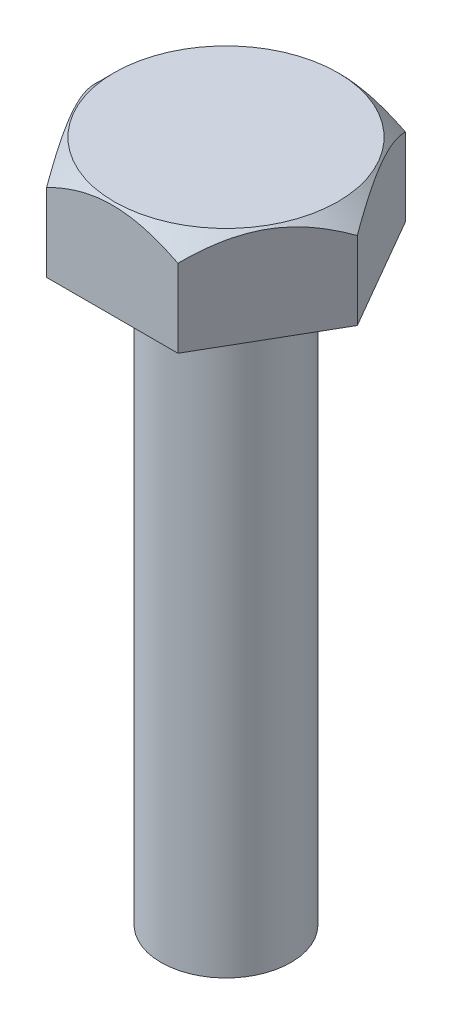
ISO-10303-21;
HEADER;
FILE_DESCRIPTION(('STEP AP214'),'2;1');
FILE_NAME('part.step','',(''),(''),'','','');
FILE_SCHEMA(('AUTOMOTIVE_DESIGN { 1 0 10303 214 1 1 1 1 }'));
ENDSEC;
DATA;
#1=APPLICATION_CONTEXT('core data for automotive mechanical design processes');
#2=APPLICATION_PROTOCOL_DEFINITION('international standard','automotive_design',2000,#1);
#3=PRODUCT_CONTEXT('',#1,'mechanical');
#4=PRODUCT('Part','Part','',(#3));
#5=PRODUCT_RELATED_PRODUCT_CATEGORY('part','',(#4));
#6=PRODUCT_DEFINITION_FORMATION('','',#4);
#7=PRODUCT_DEFINITION_CONTEXT('part definition',#1,'design');
#8=PRODUCT_DEFINITION('design','',#6,#7);
#9=PRODUCT_DEFINITION_SHAPE('','',#8);
#10=(LENGTH_UNIT() NAMED_UNIT(*) SI_UNIT(.MILLI.,.METRE.));
#11=(NAMED_UNIT(*) PLANE_ANGLE_UNIT() SI_UNIT($,.RADIAN.));
#12=(NAMED_UNIT(*) SI_UNIT($,.STERADIAN.) SOLID_ANGLE_UNIT());
#13=UNCERTAINTY_MEASURE_WITH_UNIT(LENGTH_MEASURE(1.E-05),#10,'distance_accuracy_value','');
#14=(GEOMETRIC_REPRESENTATION_CONTEXT(3) GLOBAL_UNCERTAINTY_ASSIGNED_CONTEXT((#13)) GLOBAL_UNIT_ASSIGNED_CONTEXT((#10,
#11,#12)) REPRESENTATION_CONTEXT('',''));
#15=CARTESIAN_POINT('',(0.,0.,0.));
#16=DIRECTION('',(0.,0.,1.));
#17=DIRECTION('',(1.,0.,0.));
#18=AXIS2_PLACEMENT_3D('',#15,#16,#17);
#19=CARTESIAN_POINT('',(0.,105.,0.));
#20=DIRECTION('',(0.,-1.,0.));
#21=DIRECTION('',(0.,0.,-1.));
#22=AXIS2_PLACEMENT_3D('',#19,#20,#21);
#23=CYLINDRICAL_SURFACE('',#22,10.);
#24=CARTESIAN_POINT('',(0.,0.,0.));
#25=DIRECTION('',(0.,1.,0.));
#26=DIRECTION('',(0.,0.,1.));
#27=AXIS2_PLACEMENT_3D('',#24,#25,#26);
#28=CIRCLE('',#27,10.);
#29=CARTESIAN_POINT('',(0.,0.,10.));
#30=VERTEX_POINT('',#29);
#31=EDGE_CURVE('E44',#30,#30,#28,.T.);
#32=ORIENTED_EDGE('',*,*,#31,.T.);
#33=EDGE_LOOP('',(#32));
#34=FACE_BOUND('',#33,.T.);
#35=CARTESIAN_POINT('',(0.,90.,0.));
#36=DIRECTION('',(0.,1.,0.));
#37=DIRECTION('',(0.,0.,1.));
#38=AXIS2_PLACEMENT_3D('',#35,#36,#37);
#39=CIRCLE('',#38,10.);
#40=CARTESIAN_POINT('',(0.,90.,10.));
#41=VERTEX_POINT('',#40);
#42=EDGE_CURVE('E11',#41,#41,#39,.T.);
#43=ORIENTED_EDGE('',*,*,#42,.F.);
#44=EDGE_LOOP('',(#43));
#45=FACE_BOUND('',#44,.T.);
#46=ADVANCED_FACE('F37',(#34,#45),#23,.T.);
#47=CARTESIAN_POINT('',(0.,0.,0.));
#48=DIRECTION('',(0.,1.,0.));
#49=DIRECTION('',(0.,0.,1.));
#50=AXIS2_PLACEMENT_3D('',#47,#48,#49);
#51=PLANE('',#50);
#52=ORIENTED_EDGE('',*,*,#31,.F.);
#53=EDGE_LOOP('',(#52));
#54=FACE_BOUND('',#53,.T.);
#55=ADVANCED_FACE('F216',(#54),#51,.F.);
#56=CARTESIAN_POINT('',(10.1036297108185,90.,17.5));
#57=DIRECTION('',(0.866025403784439,0.,0.5));
#58=DIRECTION('',(0.5,0.,-0.866025403784439));
#59=AXIS2_PLACEMENT_3D('',#56,#57,#58);
#60=PLANE('',#59);
#61=CARTESIAN_POINT('',(10.1035142407646,101.999884528956,17.5002));
#62=CARTESIAN_POINT('',(10.2772161959531,102.173559487261,17.1993393882395));
#63=CARTESIAN_POINT('',(10.4522785203478,102.341934743212,16.8961225478967));
#64=CARTESIAN_POINT('',(10.8053356136328,102.666402447814,16.2846097243545));
#65=CARTESIAN_POINT('',(10.9833319207208,102.822488188631,15.9763110769185));
#66=CARTESIAN_POINT('',(11.3433081877332,103.12135445128,15.352813892934));
#67=CARTESIAN_POINT('',(11.5253051210228,103.264053677999,15.0375859576548));
#68=CARTESIAN_POINT('',(11.8922882850367,103.533047605295,14.4019524720603));
#69=CARTESIAN_POINT('',(12.0772740538746,103.659344813841,14.0815477217558));
#70=CARTESIAN_POINT('',(12.44725994668,103.891538952211,13.4407133573331));
#71=CARTESIAN_POINT('',(12.6322146110496,103.997724008582,13.1203624815482));
#72=CARTESIAN_POINT('',(13.0047186861912,104.189961512046,12.4751664973764));
#73=CARTESIAN_POINT('',(13.1922678205565,104.276016086548,12.1503218677402));
#74=CARTESIAN_POINT('',(13.5691500136548,104.425830143622,11.497542760826));
#75=CARTESIAN_POINT('',(13.7584780520587,104.489639829176,11.169616979013));
#76=CARTESIAN_POINT('',(14.1387473508711,104.593546030956,10.5109712329114));
#77=CARTESIAN_POINT('',(14.3296883659053,104.633646090391,10.1802516936234));
#78=CARTESIAN_POINT('',(14.6580198048184,104.681136027447,9.61156495970376));
#79=CARTESIAN_POINT('',(14.7951975895102,104.694584979184,9.37396606694768));
#80=CARTESIAN_POINT('',(15.0697152233136,104.708570287283,8.8984875776267));
#81=CARTESIAN_POINT('',(15.2070550635686,104.709107319318,8.66060799640154));
#82=CARTESIAN_POINT('',(15.481643405491,104.697255908973,8.18500703702598));
#83=CARTESIAN_POINT('',(15.6188918561521,104.684862791294,7.94728574722088));
#84=CARTESIAN_POINT('',(15.8929528114817,104.647336049026,7.47259824821914));
#85=CARTESIAN_POINT('',(16.0297653086353,104.622202205996,7.23563205203874));
#86=CARTESIAN_POINT('',(16.3028186204356,104.559533617149,6.76268984282561));
#87=CARTESIAN_POINT('',(16.4390587105288,104.521986261661,6.52671508475635));
#88=CARTESIAN_POINT('',(16.7105947235602,104.435032232242,6.05640091410142));
#89=CARTESIAN_POINT('',(16.8458905305783,104.385624127752,5.82206170229488));
#90=CARTESIAN_POINT('',(17.2499926953934,104.220577791575,5.12213622138665));
#91=CARTESIAN_POINT('',(17.517116473681,104.088093139179,4.65946426548276));
#92=CARTESIAN_POINT('',(17.991245682429,103.81554732431,3.83824838657876));
#93=CARTESIAN_POINT('',(18.1993101803341,103.682656146477,3.47787010495577));
#94=CARTESIAN_POINT('',(18.6117124834375,103.395460303209,2.7635683628223));
#95=CARTESIAN_POINT('',(18.8160501758361,103.241154990841,2.40964509768665));
#96=CARTESIAN_POINT('',(19.2203451767528,102.914589886871,1.70938561485276));
#97=CARTESIAN_POINT('',(19.4203139893267,102.742386561871,1.36302947154561));
#98=CARTESIAN_POINT('',(19.8165491345014,102.38228567855,0.676730068358598));
#99=CARTESIAN_POINT('',(20.0128176475457,102.194397740954,0.336783031839831));
#100=CARTESIAN_POINT('',(20.2073748916907,101.999884528956,-0.000200000000004354));
#101=B_SPLINE_CURVE_WITH_KNOTS('',3,(#61,#62,#63,#64,#65,#66,#67,#68,#69,#70,#71,#72,#73,#74,
#75,#76,#77,#78,#79,#80,#81,#82,#83,#84,#85,#86,#87,#88,#89,#90,#91,#92,#93,#94,#95,#96,#97,#98,
#99,#100),.UNSPECIFIED.,.F.,.F.,(4,2,2,2,2,2,2,2,2,2,2,2,2,2,2,2,2,2,2,4),(0.,1.16524130204616,
2.331114266738,3.50366238917903,4.67603101025307,5.83006665851043,6.98398029200301,
8.13527261579806,9.28639284486991,10.110166338034,10.9338967235431,11.7579250578055,
12.5819675205788,13.4068496324916,14.2318312857993,15.8811762055264,17.1910983801914,
18.5010601368632,19.807007793264,21.112160203878),.UNSPECIFIED.);
#102=CARTESIAN_POINT('',(10.1036297108185,102.,17.5));
#103=VERTEX_POINT('',#102);
#104=CARTESIAN_POINT('',(20.2072594216369,102.,0.));
#105=VERTEX_POINT('',#104);
#106=EDGE_CURVE('E51',#103,#105,#101,.T.);
#107=ORIENTED_EDGE('',*,*,#106,.F.);
#108=DIRECTION('',(0.,1.,0.));
#109=VECTOR('',#108,1.);
#110=CARTESIAN_POINT('',(10.1036297108185,90.,17.5));
#111=LINE('',#110,#109);
#112=CARTESIAN_POINT('',(10.1036297108185,90.,17.5));
#113=VERTEX_POINT('',#112);
#114=EDGE_CURVE('E58',#113,#103,#111,.T.);
#115=ORIENTED_EDGE('',*,*,#114,.F.);
#116=DIRECTION('',(0.5,0.,-0.866025403784439));
#117=VECTOR('',#116,1.);
#118=CARTESIAN_POINT('',(10.1036297108185,90.,17.5));
#119=LINE('',#118,#117);
#120=CARTESIAN_POINT('',(20.2072594216369,90.,0.));
#121=VERTEX_POINT('',#120);
#122=EDGE_CURVE('E151',#113,#121,#119,.T.);
#123=ORIENTED_EDGE('',*,*,#122,.T.);
#124=DIRECTION('',(0.,1.,0.));
#125=VECTOR('',#124,1.);
#126=CARTESIAN_POINT('',(20.2072594216369,90.,0.));
#127=LINE('',#126,#125);
#128=EDGE_CURVE('E111',#121,#105,#127,.T.);
#129=ORIENTED_EDGE('',*,*,#128,.T.);
#130=EDGE_LOOP('',(#107,#115,#123,#129));
#131=FACE_BOUND('',#130,.T.);
#132=ADVANCED_FACE('F167',(#131),#60,.T.);
#133=CARTESIAN_POINT('',(-10.1036297108184,90.,17.5));
#134=DIRECTION('',(0.,0.,1.));
#135=DIRECTION('',(1.,0.,0.));
#136=AXIS2_PLACEMENT_3D('',#133,#134,#135);
#137=PLANE('',#136);
#138=CARTESIAN_POINT('',(-30.5325676388779,87.0151056565907,17.5));
#139=CARTESIAN_POINT('',(-30.0811443483738,87.4067427097599,17.5));
#140=CARTESIAN_POINT('',(-29.6286709800322,87.7971738588878,17.5));
#141=CARTESIAN_POINT('',(-28.7213405074518,88.5752709376982,17.5));
#142=CARTESIAN_POINT('',(-28.2664833640322,88.9629368216809,17.5));
#143=CARTESIAN_POINT('',(-27.3539016515257,89.7353189710464,17.5));
#144=CARTESIAN_POINT('',(-26.8961758321706,90.1200337603206,17.5));
#145=CARTESIAN_POINT('',(-25.9777391432718,90.8858824739251,17.5));
#146=CARTESIAN_POINT('',(-25.5170282841836,91.2670164107863,17.5));
#147=CARTESIAN_POINT('',(-24.5816363212138,92.0338692740068,17.5));
#148=CARTESIAN_POINT('',(-24.106877088839,92.4194929858136,17.5));
#149=CARTESIAN_POINT('',(-23.1533572668557,93.1857599943778,17.5));
#150=CARTESIAN_POINT('',(-22.6745967027889,93.5664033228868,17.5));
#151=CARTESIAN_POINT('',(-21.7126221962042,94.3217924346678,17.5));
#152=CARTESIAN_POINT('',(-21.22940932986,94.6965395867412,17.5));
#153=CARTESIAN_POINT('',(-20.2577585362028,95.4392071854342,17.5));
#154=CARTESIAN_POINT('',(-19.7693206134276,95.8071276379819,17.5));
#155=CARTESIAN_POINT('',(-18.7857789638369,96.5353670163242,17.5));
#156=CARTESIAN_POINT('',(-18.2906671348598,96.8956750199625,17.5));
#157=CARTESIAN_POINT('',(-17.2935024454516,97.6065895692932,17.5));
#158=CARTESIAN_POINT('',(-16.7914495073336,97.9571960062707,17.5));
#159=CARTESIAN_POINT('',(-15.7789017741243,98.6469915013257,17.5));
#160=CARTESIAN_POINT('',(-15.2684000578156,98.9861704295161,17.5));
#161=CARTESIAN_POINT('',(-14.2381564488931,99.6502217932681,17.5));
#162=CARTESIAN_POINT('',(-13.7184147574543,99.9750945397733,17.5));
#163=CARTESIAN_POINT('',(-12.672292231324,100.60485568867,17.5));
#164=CARTESIAN_POINT('',(-12.1459919750868,100.909877311582,17.5));
#165=CARTESIAN_POINT('',(-11.0814156293223,101.498541212884,17.5));
#166=CARTESIAN_POINT('',(-10.5431381069302,101.782180915306,17.5));
#167=CARTESIAN_POINT('',(-9.45407111274351,102.322433736342,17.5));
#168=CARTESIAN_POINT('',(-8.9033014129902,102.579086372801,17.5));
#169=CARTESIAN_POINT('',(-7.78766339506104,103.059301846236,17.5));
#170=CARTESIAN_POINT('',(-7.2228006510314,103.282877530888,17.5));
#171=CARTESIAN_POINT('',(-6.06517838156233,103.69408987098,17.5));
#172=CARTESIAN_POINT('',(-5.47207605375813,103.880781927734,17.5));
#173=CARTESIAN_POINT('',(-4.57212324547136,104.122163886821,17.5));
#174=CARTESIAN_POINT('',(-4.27039547737193,104.196186654115,17.5));
#175=CARTESIAN_POINT('',(-3.66387043513104,104.330276020648,17.5));
#176=CARTESIAN_POINT('',(-3.35907360532274,104.390344610678,17.5));
#177=CARTESIAN_POINT('',(-2.74876776750407,104.495232187443,17.5));
#178=CARTESIAN_POINT('',(-2.44327437163515,104.540141720053,17.5));
#179=CARTESIAN_POINT('',(-1.8303964739302,104.614424450311,17.5));
#180=CARTESIAN_POINT('',(-1.52301199116516,104.643797804377,17.5));
#181=CARTESIAN_POINT('',(-0.907145531115893,104.686455825431,17.5));
#182=CARTESIAN_POINT('',(-0.598663636350465,104.699741677488,17.5));
#183=CARTESIAN_POINT('',(0.0185727020880551,104.70997027456,17.5));
#184=CARTESIAN_POINT('',(0.327327145985168,104.706913006128,17.5));
#185=CARTESIAN_POINT('',(0.944664763992658,104.6844997037,17.5));
#186=CARTESIAN_POINT('',(1.25324712357679,104.665121339961,17.5));
#187=CARTESIAN_POINT('',(1.86898613461836,104.610411454788,17.5));
#188=CARTESIAN_POINT('',(2.17614278086749,104.575079875122,17.5));
#189=CARTESIAN_POINT('',(2.7883207294646,104.489108022994,17.5));
#190=CARTESIAN_POINT('',(3.0933418943693,104.438466774275,17.5));
#191=CARTESIAN_POINT('',(3.70064748979663,104.322745185528,17.5));
#192=CARTESIAN_POINT('',(4.0029314736885,104.257662531734,17.5));
#193=CARTESIAN_POINT('',(4.90913115305588,104.04124198752,17.5));
#194=CARTESIAN_POINT('',(5.508243034706,103.869337161337,17.5));
#195=CARTESIAN_POINT('',(6.39528929251341,103.577403705749,17.5));
#196=CARTESIAN_POINT('',(6.68905683852774,103.474403851543,17.5));
#197=CARTESIAN_POINT('',(7.27280078128238,103.258110424553,17.5));
#198=CARTESIAN_POINT('',(7.56277708405164,103.14481659717,17.5));
#199=CARTESIAN_POINT('',(8.55557099499896,102.738467971111,17.5));
#200=CARTESIAN_POINT('',(9.24900935678831,102.422377688972,17.5));
#201=CARTESIAN_POINT('',(10.6151780406726,101.748061581731,17.5));
#202=CARTESIAN_POINT('',(11.2878961275753,101.389811441324,17.5));
#203=CARTESIAN_POINT('',(12.6165140490179,100.640502499843,17.5));
#204=CARTESIAN_POINT('',(13.2723762104463,100.249377356984,17.5));
#205=CARTESIAN_POINT('',(14.5684856687915,99.4425119786291,17.5));
#206=CARTESIAN_POINT('',(15.2087360391248,99.0267766441698,17.5));
#207=CARTESIAN_POINT('',(16.4796616028655,98.1738190395144,17.5));
#208=CARTESIAN_POINT('',(17.1102674783144,97.7364939573805,17.5));
#209=CARTESIAN_POINT('',(18.3605608533364,96.8465121401103,17.5));
#210=CARTESIAN_POINT('',(18.9802479332237,96.3938548175944,17.5));
#211=CARTESIAN_POINT('',(20.2097542827236,95.476813072476,17.5));
#212=CARTESIAN_POINT('',(20.8195840365379,95.0124426678031,17.5));
#213=CARTESIAN_POINT('',(22.0315350381499,94.0737976377681,17.5));
#214=CARTESIAN_POINT('',(22.6336564535872,93.5995232283886,17.5));
#215=CARTESIAN_POINT('',(23.8555890429097,92.6235036643579,17.5));
#216=CARTESIAN_POINT('',(24.4751317395324,92.121422918288,17.5));
#217=CARTESIAN_POINT('',(25.708362200348,91.1099032651416,17.5));
#218=CARTESIAN_POINT('',(26.3220488713258,90.6004630271391,17.5));
#219=CARTESIAN_POINT('',(27.5376760994529,89.581120610703,17.5));
#220=CARTESIAN_POINT('',(28.1396717674392,89.0712840625553,17.5));
#221=CARTESIAN_POINT('',(29.3392368752199,88.0466900081939,17.5));
#222=CARTESIAN_POINT('',(29.9368072470162,87.5319335936601,17.5));
#223=CARTESIAN_POINT('',(30.5325676388779,87.0151056565907,17.5));
#224=B_SPLINE_CURVE_WITH_KNOTS('',3,(#138,#139,#140,#141,#142,#143,#144,#145,#146,#147,#148,
#149,#150,#151,#152,#153,#154,#155,#156,#157,#158,#159,#160,#161,#162,#163,#164,#165,#166,#167,
#168,#169,#170,#171,#172,#173,#174,#175,#176,#177,#178,#179,#180,#181,#182,#183,#184,#185,#186,
#187,#188,#189,#190,#191,#192,#193,#194,#195,#196,#197,#198,#199,#200,#201,#202,#203,#204,#205,
#206,#207,#208,#209,#210,#211,#212,#213,#214,#215,#216,#217,#218,#219,#220,#221,#222,#223),
.UNSPECIFIED.,.F.,.F.,(4,2,2,2,2,2,2,2,2,2,2,2,2,2,2,2,2,2,2,2,2,2,2,2,2,2,2,2,2,2,2,2,2,2,2,2,
2,2,2,2,2,2,4),(0.,1.79289460227017,3.58581876620533,5.37958785064601,7.17335065554993,
9.00823802653412,10.8431136938018,12.6775569141841,14.5119985415212,16.3489144367239,
18.1858509079122,20.0243750338745,21.8628591799397,23.6873581179657,25.5120765106955,
27.3340845793558,29.1553830791008,31.0185607849005,31.9503132795117,32.8819327627053,
33.8078848677645,34.7338276501633,35.6597022198772,36.5855775513202,37.512721682729,
38.4398691984559,39.3670758483185,40.294431160282,42.1616813828862,43.0954517004442,
44.0292451190388,46.313373303975,48.5988253548935,50.8890055865899,53.1787312610068,
55.4806742183643,57.7827054633504,60.0821014317551,62.3814473080469,64.7737153436598,
67.1664215633696,69.5330331118404,71.8991311864877),.UNSPECIFIED.);
#225=CARTESIAN_POINT('',(-10.1036297108184,102.,17.5));
#226=VERTEX_POINT('',#225);
#227=EDGE_CURVE('E160',#226,#103,#224,.T.);
#228=ORIENTED_EDGE('',*,*,#227,.F.);
#229=DIRECTION('',(0.,1.,0.));
#230=VECTOR('',#229,1.);
#231=CARTESIAN_POINT('',(-10.1036297108184,90.,17.5));
#232=LINE('',#231,#230);
#233=CARTESIAN_POINT('',(-10.1036297108184,90.,17.5));
#234=VERTEX_POINT('',#233);
#235=EDGE_CURVE('E121',#234,#226,#232,.T.);
#236=ORIENTED_EDGE('',*,*,#235,.F.);
#237=DIRECTION('',(1.,0.,0.));
#238=VECTOR('',#237,1.);
#239=CARTESIAN_POINT('',(-10.1036297108184,90.,17.5));
#240=LINE('',#239,#238);
#241=EDGE_CURVE('E115',#234,#113,#240,.T.);
#242=ORIENTED_EDGE('',*,*,#241,.T.);
#243=ORIENTED_EDGE('',*,*,#114,.T.);
#244=EDGE_LOOP('',(#228,#236,#242,#243));
#245=FACE_BOUND('',#244,.T.);
#246=ADVANCED_FACE('F203',(#245),#137,.T.);
#247=CARTESIAN_POINT('',(-20.2072594216369,90.,0.));
#248=DIRECTION('',(-0.866025403784438,0.,0.5));
#249=DIRECTION('',(0.5,0.,0.866025403784438));
#250=AXIS2_PLACEMENT_3D('',#247,#248,#249);
#251=PLANE('',#250);
#252=CARTESIAN_POINT('',(-20.2073748916907,101.999884528956,-0.000200000000000505));
#253=CARTESIAN_POINT('',(-20.0336729365023,102.173559487261,0.300660611760495));
#254=CARTESIAN_POINT('',(-19.8586106121075,102.341934743212,0.603877452103252));
#255=CARTESIAN_POINT('',(-19.5055535188225,102.666402447814,1.21539027564551));
#256=CARTESIAN_POINT('',(-19.3275572117345,102.822488188631,1.52368892308151));
#257=CARTESIAN_POINT('',(-18.9675809447221,103.12135445128,2.14718610706599));
#258=CARTESIAN_POINT('',(-18.7855840114326,103.264053677999,2.46241404234517));
#259=CARTESIAN_POINT('',(-18.4186008474187,103.533047605295,3.09804752793967));
#260=CARTESIAN_POINT('',(-18.2336150785807,103.659344813841,3.41845227824416));
#261=CARTESIAN_POINT('',(-17.8636291857753,103.891538952211,4.05928664266687));
#262=CARTESIAN_POINT('',(-17.6786745214058,103.997724008582,4.37963751845174));
#263=CARTESIAN_POINT('',(-17.3061704462641,104.189961512046,5.02483350262359));
#264=CARTESIAN_POINT('',(-17.1186213118988,104.276016086548,5.34967813225984));
#265=CARTESIAN_POINT('',(-16.7417391188006,104.425830143622,6.00245723917394));
#266=CARTESIAN_POINT('',(-16.5524110803966,104.489639829176,6.330383020987));
#267=CARTESIAN_POINT('',(-16.1721417815843,104.593546030956,6.98902876708857));
#268=CARTESIAN_POINT('',(-15.9812007665501,104.633646090391,7.31974830637656));
#269=CARTESIAN_POINT('',(-15.652869327637,104.681136027447,7.88843504029622));
#270=CARTESIAN_POINT('',(-15.5156915429451,104.694584979184,8.12603393305231));
#271=CARTESIAN_POINT('',(-15.2411739091418,104.708570287283,8.60151242237328));
#272=CARTESIAN_POINT('',(-15.1038340688867,104.709107319318,8.83939200359844));
#273=CARTESIAN_POINT('',(-14.8292457269644,104.697255908973,9.314992962974));
#274=CARTESIAN_POINT('',(-14.6919972763033,104.684862791294,9.5527142527791));
#275=CARTESIAN_POINT('',(-14.4179363209737,104.647336049026,10.0274017517808));
#276=CARTESIAN_POINT('',(-14.2811238238201,104.622202205996,10.2643679479612));
#277=CARTESIAN_POINT('',(-14.0080705120198,104.559533617149,10.7373101571744));
#278=CARTESIAN_POINT('',(-13.8718304219265,104.521986261661,10.9732849152436));
#279=CARTESIAN_POINT('',(-13.6002944088952,104.435032232242,11.4435990858986));
#280=CARTESIAN_POINT('',(-13.464998601877,104.385624127752,11.6779382977051));
#281=CARTESIAN_POINT('',(-13.060896437062,104.220577791575,12.3778637786133));
#282=CARTESIAN_POINT('',(-12.7937726587744,104.088093139179,12.8405357345172));
#283=CARTESIAN_POINT('',(-12.3196434500264,103.81554732431,13.6617516134212));
#284=CARTESIAN_POINT('',(-12.1115789521212,103.682656146477,14.0221298950442));
#285=CARTESIAN_POINT('',(-11.6991766490178,103.395460303209,14.7364316371777));
#286=CARTESIAN_POINT('',(-11.4948389566193,103.241154990841,15.0903549023133));
#287=CARTESIAN_POINT('',(-11.0905439557026,102.914589886871,15.7906143851472));
#288=CARTESIAN_POINT('',(-10.8905751431287,102.742386561871,16.1369705284544));
#289=CARTESIAN_POINT('',(-10.494339997954,102.38228567855,16.8232699316414));
#290=CARTESIAN_POINT('',(-10.2980714849097,102.194397740954,17.1632169681602));
#291=CARTESIAN_POINT('',(-10.1035142407646,101.999884528956,17.5002));
#292=B_SPLINE_CURVE_WITH_KNOTS('',3,(#252,#253,#254,#255,#256,#257,#258,#259,#260,#261,#262,
#263,#264,#265,#266,#267,#268,#269,#270,#271,#272,#273,#274,#275,#276,#277,#278,#279,#280,#281,
#282,#283,#284,#285,#286,#287,#288,#289,#290,#291),.UNSPECIFIED.,.F.,.F.,(4,2,2,2,2,2,2,2,2,2,2,
2,2,2,2,2,2,2,2,4),(0.,1.16524130204615,2.331114266738,3.50366238917901,4.67603101025306,
5.83006665851041,6.983980292003,8.13527261579804,9.28639284486989,10.110166338034,
10.933896723543,11.7579250578055,12.5819675205788,13.4068496324916,14.2318312857993,
15.8811762055264,17.1910983801914,18.5010601368632,19.807007793264,21.112160203878),.UNSPECIFIED.);
#293=CARTESIAN_POINT('',(-20.2072594216369,102.,0.));
#294=VERTEX_POINT('',#293);
#295=EDGE_CURVE('E143',#294,#226,#292,.T.);
#296=ORIENTED_EDGE('',*,*,#295,.F.);
#297=DIRECTION('',(0.,1.,0.));
#298=VECTOR('',#297,1.);
#299=CARTESIAN_POINT('',(-20.2072594216369,90.,0.));
#300=LINE('',#299,#298);
#301=CARTESIAN_POINT('',(-20.2072594216369,90.,0.));
#302=VERTEX_POINT('',#301);
#303=EDGE_CURVE('E113',#302,#294,#300,.T.);
#304=ORIENTED_EDGE('',*,*,#303,.F.);
#305=DIRECTION('',(0.5,0.,0.866025403784438));
#306=VECTOR('',#305,1.);
#307=CARTESIAN_POINT('',(-20.2072594216369,90.,0.));
#308=LINE('',#307,#306);
#309=EDGE_CURVE('E141',#302,#234,#308,.T.);
#310=ORIENTED_EDGE('',*,*,#309,.T.);
#311=ORIENTED_EDGE('',*,*,#235,.T.);
#312=EDGE_LOOP('',(#296,#304,#310,#311));
#313=FACE_BOUND('',#312,.T.);
#314=ADVANCED_FACE('F140',(#313),#251,.T.);
#315=CARTESIAN_POINT('',(-10.1036297108185,90.,-17.5));
#316=DIRECTION('',(-0.866025403784438,0.,-0.5));
#317=DIRECTION('',(-0.5,0.,0.866025403784439));
#318=AXIS2_PLACEMENT_3D('',#315,#316,#317);
#319=PLANE('',#318);
#320=CARTESIAN_POINT('',(-10.1035142407646,101.999884528956,-17.5002));
#321=CARTESIAN_POINT('',(-10.2772161959531,102.173559487261,-17.1993393882395));
#322=CARTESIAN_POINT('',(-10.4522785203478,102.341934743212,-16.8961225478967));
#323=CARTESIAN_POINT('',(-10.8053356136328,102.666402447814,-16.2846097243545));
#324=CARTESIAN_POINT('',(-10.9833319207208,102.822488188631,-15.9763110769185));
#325=CARTESIAN_POINT('',(-11.3433081877332,103.12135445128,-15.352813892934));
#326=CARTESIAN_POINT('',(-11.5253051210228,103.264053677999,-15.0375859576548));
#327=CARTESIAN_POINT('',(-11.8922882850367,103.533047605295,-14.4019524720603));
#328=CARTESIAN_POINT('',(-12.0772740538746,103.659344813841,-14.0815477217558));
#329=CARTESIAN_POINT('',(-12.44725994668,103.891538952211,-13.4407133573331));
#330=CARTESIAN_POINT('',(-12.6322146110495,103.997724008582,-13.1203624815483));
#331=CARTESIAN_POINT('',(-13.0047186861912,104.189961512046,-12.4751664973764));
#332=CARTESIAN_POINT('',(-13.1922678205565,104.276016086548,-12.1503218677402));
#333=CARTESIAN_POINT('',(-13.5691500136547,104.425830143622,-11.4975427608261));
#334=CARTESIAN_POINT('',(-13.7584780520587,104.489639829176,-11.169616979013));
#335=CARTESIAN_POINT('',(-14.1387473508711,104.593546030956,-10.5109712329114));
#336=CARTESIAN_POINT('',(-14.3296883659053,104.633646090391,-10.1802516936234));
#337=CARTESIAN_POINT('',(-14.6580198048184,104.681136027447,-9.61156495970376));
#338=CARTESIAN_POINT('',(-14.7951975895102,104.694584979184,-9.37396606694768));
#339=CARTESIAN_POINT('',(-15.0697152233136,104.708570287283,-8.89848757762671));
#340=CARTESIAN_POINT('',(-15.2070550635686,104.709107319318,-8.66060799640154));
#341=CARTESIAN_POINT('',(-15.481643405491,104.697255908973,-8.18500703702599));
#342=CARTESIAN_POINT('',(-15.618891856152,104.684862791294,-7.94728574722089));
#343=CARTESIAN_POINT('',(-15.8929528114817,104.647336049026,-7.47259824821915));
#344=CARTESIAN_POINT('',(-16.0297653086352,104.622202205996,-7.23563205203875));
#345=CARTESIAN_POINT('',(-16.3028186204356,104.559533617149,-6.76268984282562));
#346=CARTESIAN_POINT('',(-16.4390587105288,104.521986261661,-6.52671508475636));
#347=CARTESIAN_POINT('',(-16.7105947235601,104.435032232242,-6.05640091410143));
#348=CARTESIAN_POINT('',(-16.8458905305783,104.385624127752,-5.82206170229489));
#349=CARTESIAN_POINT('',(-17.2499926953934,104.220577791575,-5.12213622138666));
#350=CARTESIAN_POINT('',(-17.517116473681,104.088093139179,-4.65946426548277));
#351=CARTESIAN_POINT('',(-17.991245682429,103.81554732431,-3.83824838657878));
#352=CARTESIAN_POINT('',(-18.1993101803341,103.682656146477,-3.47787010495578));
#353=CARTESIAN_POINT('',(-18.6117124834375,103.395460303209,-2.76356836282231));
#354=CARTESIAN_POINT('',(-18.8160501758361,103.241154990841,-2.40964509768665));
#355=CARTESIAN_POINT('',(-19.2203451767528,102.914589886871,-1.70938561485277));
#356=CARTESIAN_POINT('',(-19.4203139893267,102.742386561871,-1.36302947154562));
#357=CARTESIAN_POINT('',(-19.8165491345014,102.38228567855,-0.676730068358607));
#358=CARTESIAN_POINT('',(-20.0128176475457,102.194397740954,-0.336783031839839));
#359=CARTESIAN_POINT('',(-20.2073748916907,101.999884528956,0.000200000000000883));
#360=B_SPLINE_CURVE_WITH_KNOTS('',3,(#320,#321,#322,#323,#324,#325,#326,#327,#328,#329,#330,
#331,#332,#333,#334,#335,#336,#337,#338,#339,#340,#341,#342,#343,#344,#345,#346,#347,#348,#349,
#350,#351,#352,#353,#354,#355,#356,#357,#358,#359),.UNSPECIFIED.,.F.,.F.,(4,2,2,2,2,2,2,2,2,2,2,
2,2,2,2,2,2,2,2,4),(0.,1.16524130204617,2.33111426673802,3.50366238917903,4.67603101025306,
5.83006665851042,6.98398029200301,8.13527261579805,9.2863928448699,10.110166338034,
10.9338967235431,11.7579250578055,12.5819675205788,13.4068496324916,14.2318312857993,
15.8811762055264,17.1910983801914,18.5010601368632,19.807007793264,21.112160203878),.UNSPECIFIED.);
#361=CARTESIAN_POINT('',(-10.1036297108185,102.,-17.5));
#362=VERTEX_POINT('',#361);
#363=EDGE_CURVE('E105',#362,#294,#360,.T.);
#364=ORIENTED_EDGE('',*,*,#363,.F.);
#365=DIRECTION('',(0.,1.,0.));
#366=VECTOR('',#365,1.);
#367=CARTESIAN_POINT('',(-10.1036297108185,90.,-17.5));
#368=LINE('',#367,#366);
#369=CARTESIAN_POINT('',(-10.1036297108185,90.,-17.5));
#370=VERTEX_POINT('',#369);
#371=EDGE_CURVE('E104',#370,#362,#368,.T.);
#372=ORIENTED_EDGE('',*,*,#371,.F.);
#373=DIRECTION('',(-0.5,0.,0.866025403784439));
#374=VECTOR('',#373,1.);
#375=CARTESIAN_POINT('',(-10.1036297108185,90.,-17.5));
#376=LINE('',#375,#374);
#377=EDGE_CURVE('E135',#370,#302,#376,.T.);
#378=ORIENTED_EDGE('',*,*,#377,.T.);
#379=ORIENTED_EDGE('',*,*,#303,.T.);
#380=EDGE_LOOP('',(#364,#372,#378,#379));
#381=FACE_BOUND('',#380,.T.);
#382=ADVANCED_FACE('F133',(#381),#319,.T.);
#383=CARTESIAN_POINT('',(10.1036297108184,90.,-17.5));
#384=DIRECTION('',(0.,0.,-1.));
#385=DIRECTION('',(-1.,0.,0.));
#386=AXIS2_PLACEMENT_3D('',#383,#384,#385);
#387=PLANE('',#386);
#388=CARTESIAN_POINT('',(30.5325676388779,87.0151056565907,-17.5));
#389=CARTESIAN_POINT('',(30.0811443483738,87.4067427097599,-17.5));
#390=CARTESIAN_POINT('',(29.6286709800322,87.7971738588878,-17.5));
#391=CARTESIAN_POINT('',(28.7213405074518,88.5752709376982,-17.5));
#392=CARTESIAN_POINT('',(28.2664833640322,88.9629368216809,-17.5));
#393=CARTESIAN_POINT('',(27.3539016515257,89.7353189710464,-17.5));
#394=CARTESIAN_POINT('',(26.8961758321706,90.1200337603206,-17.5));
#395=CARTESIAN_POINT('',(25.9777391432718,90.8858824739251,-17.5));
#396=CARTESIAN_POINT('',(25.5170282841836,91.2670164107863,-17.5));
#397=CARTESIAN_POINT('',(24.5816363212138,92.0338692740068,-17.5));
#398=CARTESIAN_POINT('',(24.106877088839,92.4194929858137,-17.5));
#399=CARTESIAN_POINT('',(23.1533572668557,93.1857599943778,-17.5));
#400=CARTESIAN_POINT('',(22.6745967027889,93.5664033228868,-17.5));
#401=CARTESIAN_POINT('',(21.7126221962042,94.3217924346678,-17.5));
#402=CARTESIAN_POINT('',(21.22940932986,94.6965395867412,-17.5));
#403=CARTESIAN_POINT('',(20.2577585362028,95.4392071854342,-17.5));
#404=CARTESIAN_POINT('',(19.7693206134276,95.8071276379819,-17.5));
#405=CARTESIAN_POINT('',(18.7857789638369,96.5353670163242,-17.5));
#406=CARTESIAN_POINT('',(18.2906671348598,96.8956750199625,-17.5));
#407=CARTESIAN_POINT('',(17.2935024454516,97.6065895692932,-17.5));
#408=CARTESIAN_POINT('',(16.7914495073336,97.9571960062707,-17.5));
#409=CARTESIAN_POINT('',(15.7789017741243,98.6469915013257,-17.5));
#410=CARTESIAN_POINT('',(15.2684000578156,98.9861704295161,-17.5));
#411=CARTESIAN_POINT('',(14.2381564488931,99.6502217932681,-17.5));
#412=CARTESIAN_POINT('',(13.7184147574543,99.9750945397733,-17.5));
#413=CARTESIAN_POINT('',(12.672292231324,100.60485568867,-17.5));
#414=CARTESIAN_POINT('',(12.1459919750867,100.909877311582,-17.5));
#415=CARTESIAN_POINT('',(11.0814156293223,101.498541212884,-17.5));
#416=CARTESIAN_POINT('',(10.5431381069302,101.782180915306,-17.5));
#417=CARTESIAN_POINT('',(9.45407111274351,102.322433736342,-17.5));
#418=CARTESIAN_POINT('',(8.9033014129902,102.579086372801,-17.5));
#419=CARTESIAN_POINT('',(7.78766339506104,103.059301846236,-17.5));
#420=CARTESIAN_POINT('',(7.22280065103139,103.282877530888,-17.5));
#421=CARTESIAN_POINT('',(6.06517838156233,103.69408987098,-17.5));
#422=CARTESIAN_POINT('',(5.47207605375812,103.880781927734,-17.5));
#423=CARTESIAN_POINT('',(4.57212324547135,104.122163886821,-17.5));
#424=CARTESIAN_POINT('',(4.27039547737193,104.196186654115,-17.5));
#425=CARTESIAN_POINT('',(3.66387043513104,104.330276020648,-17.5));
#426=CARTESIAN_POINT('',(3.35907360532274,104.390344610678,-17.5));
#427=CARTESIAN_POINT('',(2.74876776750408,104.495232187443,-17.5));
#428=CARTESIAN_POINT('',(2.44327437163515,104.540141720053,-17.5));
#429=CARTESIAN_POINT('',(1.8303964739302,104.614424450311,-17.5));
#430=CARTESIAN_POINT('',(1.52301199116517,104.643797804377,-17.5));
#431=CARTESIAN_POINT('',(0.907145531115895,104.686455825431,-17.5));
#432=CARTESIAN_POINT('',(0.598663636350466,104.699741677488,-17.5));
#433=CARTESIAN_POINT('',(-0.0185727020880571,104.70997027456,-17.5));
#434=CARTESIAN_POINT('',(-0.327327145985172,104.706913006128,-17.5));
#435=CARTESIAN_POINT('',(-0.944664763992665,104.6844997037,-17.5));
#436=CARTESIAN_POINT('',(-1.25324712357679,104.665121339961,-17.5));
#437=CARTESIAN_POINT('',(-1.86898613461837,104.610411454788,-17.5));
#438=CARTESIAN_POINT('',(-2.1761427808675,104.575079875122,-17.5));
#439=CARTESIAN_POINT('',(-2.7883207294646,104.489108022994,-17.5));
#440=CARTESIAN_POINT('',(-3.0933418943693,104.438466774275,-17.5));
#441=CARTESIAN_POINT('',(-3.70064748979663,104.322745185528,-17.5));
#442=CARTESIAN_POINT('',(-4.00293147368851,104.257662531733,-17.5));
#443=CARTESIAN_POINT('',(-4.90913115305589,104.04124198752,-17.5));
#444=CARTESIAN_POINT('',(-5.508243034706,103.869337161337,-17.5));
#445=CARTESIAN_POINT('',(-6.39528929251342,103.577403705749,-17.5));
#446=CARTESIAN_POINT('',(-6.68905683852775,103.474403851543,-17.5));
#447=CARTESIAN_POINT('',(-7.27280078128238,103.258110424553,-17.5));
#448=CARTESIAN_POINT('',(-7.56277708405165,103.14481659717,-17.5));
#449=CARTESIAN_POINT('',(-8.55557099499897,102.738467971111,-17.5));
#450=CARTESIAN_POINT('',(-9.24900935678832,102.422377688972,-17.5));
#451=CARTESIAN_POINT('',(-10.6151780406726,101.748061581731,-17.5));
#452=CARTESIAN_POINT('',(-11.2878961275753,101.389811441324,-17.5));
#453=CARTESIAN_POINT('',(-12.6165140490179,100.640502499843,-17.5));
#454=CARTESIAN_POINT('',(-13.2723762104463,100.249377356984,-17.5));
#455=CARTESIAN_POINT('',(-14.5684856687915,99.4425119786291,-17.5));
#456=CARTESIAN_POINT('',(-15.2087360391248,99.0267766441698,-17.5));
#457=CARTESIAN_POINT('',(-16.4796616028655,98.1738190395144,-17.5));
#458=CARTESIAN_POINT('',(-17.1102674783144,97.7364939573805,-17.5));
#459=CARTESIAN_POINT('',(-18.3605608533364,96.8465121401103,-17.5));
#460=CARTESIAN_POINT('',(-18.9802479332237,96.3938548175944,-17.5));
#461=CARTESIAN_POINT('',(-20.2097542827235,95.476813072476,-17.5));
#462=CARTESIAN_POINT('',(-20.8195840365379,95.0124426678031,-17.5));
#463=CARTESIAN_POINT('',(-22.0315350381499,94.0737976377681,-17.5));
#464=CARTESIAN_POINT('',(-22.6336564535872,93.5995232283886,-17.5));
#465=CARTESIAN_POINT('',(-23.8555890429097,92.6235036643579,-17.5));
#466=CARTESIAN_POINT('',(-24.4751317395324,92.121422918288,-17.5));
#467=CARTESIAN_POINT('',(-25.708362200348,91.1099032651416,-17.5));
#468=CARTESIAN_POINT('',(-26.3220488713258,90.6004630271391,-17.5));
#469=CARTESIAN_POINT('',(-27.5376760994529,89.581120610703,-17.5));
#470=CARTESIAN_POINT('',(-28.1396717674392,89.0712840625553,-17.5));
#471=CARTESIAN_POINT('',(-29.3392368752199,88.0466900081939,-17.5));
#472=CARTESIAN_POINT('',(-29.9368072470162,87.5319335936601,-17.5));
#473=CARTESIAN_POINT('',(-30.5325676388779,87.0151056565907,-17.5));
#474=B_SPLINE_CURVE_WITH_KNOTS('',3,(#388,#389,#390,#391,#392,#393,#394,#395,#396,#397,#398,
#399,#400,#401,#402,#403,#404,#405,#406,#407,#408,#409,#410,#411,#412,#413,#414,#415,#416,#417,
#418,#419,#420,#421,#422,#423,#424,#425,#426,#427,#428,#429,#430,#431,#432,#433,#434,#435,#436,
#437,#438,#439,#440,#441,#442,#443,#444,#445,#446,#447,#448,#449,#450,#451,#452,#453,#454,#455,
#456,#457,#458,#459,#460,#461,#462,#463,#464,#465,#466,#467,#468,#469,#470,#471,#472,#473),
.UNSPECIFIED.,.F.,.F.,(4,2,2,2,2,2,2,2,2,2,2,2,2,2,2,2,2,2,2,2,2,2,2,2,2,2,2,2,2,2,2,2,2,2,2,2,
2,2,2,2,2,2,4),(0.,1.79289460227018,3.58581876620533,5.379587850646,7.17335065554993,
9.00823802653413,10.8431136938018,12.6775569141841,14.5119985415212,16.3489144367239,
18.1858509079122,20.0243750338745,21.8628591799397,23.6873581179657,25.5120765106955,
27.3340845793558,29.1553830791009,31.0185607849005,31.9503132795117,32.8819327627053,
33.8078848677645,34.7338276501633,35.6597022198772,36.5855775513202,37.512721682729,
38.4398691984559,39.3670758483185,40.294431160282,42.1616813828862,43.0954517004442,
44.0292451190388,46.313373303975,48.5988253548935,50.8890055865899,53.1787312610068,
55.4806742183643,57.7827054633504,60.0821014317551,62.381447308047,64.7737153436598,
67.1664215633696,69.5330331118404,71.8991311864877),.UNSPECIFIED.);
#475=CARTESIAN_POINT('',(10.1036297108184,102.,-17.5));
#476=VERTEX_POINT('',#475);
#477=EDGE_CURVE('E91',#476,#362,#474,.T.);
#478=ORIENTED_EDGE('',*,*,#477,.F.);
#479=DIRECTION('',(0.,1.,0.));
#480=VECTOR('',#479,1.);
#481=CARTESIAN_POINT('',(10.1036297108184,90.,-17.5));
#482=LINE('',#481,#480);
#483=CARTESIAN_POINT('',(10.1036297108184,90.,-17.5));
#484=VERTEX_POINT('',#483);
#485=EDGE_CURVE('E102',#484,#476,#482,.T.);
#486=ORIENTED_EDGE('',*,*,#485,.F.);
#487=DIRECTION('',(-1.,0.,0.));
#488=VECTOR('',#487,1.);
#489=CARTESIAN_POINT('',(10.1036297108184,90.,-17.5));
#490=LINE('',#489,#488);
#491=EDGE_CURVE('E146',#484,#370,#490,.T.);
#492=ORIENTED_EDGE('',*,*,#491,.T.);
#493=ORIENTED_EDGE('',*,*,#371,.T.);
#494=EDGE_LOOP('',(#478,#486,#492,#493));
#495=FACE_BOUND('',#494,.T.);
#496=ADVANCED_FACE('F100',(#495),#387,.T.);
#497=CARTESIAN_POINT('',(20.2072594216369,90.,0.));
#498=DIRECTION('',(0.866025403784438,0.,-0.5));
#499=DIRECTION('',(-0.5,0.,-0.866025403784439));
#500=AXIS2_PLACEMENT_3D('',#497,#498,#499);
#501=PLANE('',#500);
#502=CARTESIAN_POINT('',(20.2073748916907,101.999884528956,0.000199999999998399));
#503=CARTESIAN_POINT('',(20.0336729365023,102.173559487261,-0.300660611760497));
#504=CARTESIAN_POINT('',(19.8586106121075,102.341934743212,-0.603877452103253));
#505=CARTESIAN_POINT('',(19.5055535188225,102.666402447814,-1.21539027564551));
#506=CARTESIAN_POINT('',(19.3275572117345,102.822488188631,-1.52368892308151));
#507=CARTESIAN_POINT('',(18.9675809447221,103.12135445128,-2.14718610706599));
#508=CARTESIAN_POINT('',(18.7855840114326,103.264053677999,-2.46241404234517));
#509=CARTESIAN_POINT('',(18.4186008474187,103.533047605295,-3.09804752793967));
#510=CARTESIAN_POINT('',(18.2336150785808,103.659344813841,-3.41845227824416));
#511=CARTESIAN_POINT('',(17.8636291857753,103.891538952211,-4.05928664266686));
#512=CARTESIAN_POINT('',(17.6786745214058,103.997724008582,-4.37963751845174));
#513=CARTESIAN_POINT('',(17.3061704462641,104.189961512046,-5.02483350262359));
#514=CARTESIAN_POINT('',(17.1186213118988,104.276016086548,-5.34967813225983));
#515=CARTESIAN_POINT('',(16.7417391188006,104.425830143622,-6.00245723917394));
#516=CARTESIAN_POINT('',(16.5524110803966,104.489639829176,-6.33038302098699));
#517=CARTESIAN_POINT('',(16.1721417815843,104.593546030956,-6.98902876708856));
#518=CARTESIAN_POINT('',(15.9812007665501,104.633646090391,-7.31974830637656));
#519=CARTESIAN_POINT('',(15.652869327637,104.681136027447,-7.88843504029621));
#520=CARTESIAN_POINT('',(15.5156915429451,104.694584979184,-8.1260339330523));
#521=CARTESIAN_POINT('',(15.2411739091418,104.708570287283,-8.60151242237327));
#522=CARTESIAN_POINT('',(15.1038340688867,104.709107319318,-8.83939200359844));
#523=CARTESIAN_POINT('',(14.8292457269644,104.697255908973,-9.31499296297399));
#524=CARTESIAN_POINT('',(14.6919972763033,104.684862791294,-9.55271425277909));
#525=CARTESIAN_POINT('',(14.4179363209737,104.647336049026,-10.0274017517808));
#526=CARTESIAN_POINT('',(14.2811238238201,104.622202205996,-10.2643679479612));
#527=CARTESIAN_POINT('',(14.0080705120198,104.559533617149,-10.7373101571744));
#528=CARTESIAN_POINT('',(13.8718304219265,104.521986261661,-10.9732849152436));
#529=CARTESIAN_POINT('',(13.6002944088952,104.435032232242,-11.4435990858986));
#530=CARTESIAN_POINT('',(13.464998601877,104.385624127752,-11.6779382977051));
#531=CARTESIAN_POINT('',(13.060896437062,104.220577791575,-12.3778637786133));
#532=CARTESIAN_POINT('',(12.7937726587744,104.088093139179,-12.8405357345172));
#533=CARTESIAN_POINT('',(12.3196434500264,103.81554732431,-13.6617516134212));
#534=CARTESIAN_POINT('',(12.1115789521212,103.682656146477,-14.0221298950442));
#535=CARTESIAN_POINT('',(11.6991766490179,103.395460303209,-14.7364316371777));
#536=CARTESIAN_POINT('',(11.4948389566193,103.241154990841,-15.0903549023133));
#537=CARTESIAN_POINT('',(11.0905439557026,102.914589886871,-15.7906143851472));
#538=CARTESIAN_POINT('',(10.8905751431287,102.742386561871,-16.1369705284544));
#539=CARTESIAN_POINT('',(10.494339997954,102.38228567855,-16.8232699316414));
#540=CARTESIAN_POINT('',(10.2980714849097,102.194397740954,-17.1632169681602));
#541=CARTESIAN_POINT('',(10.1035142407646,101.999884528956,-17.5002));
#542=B_SPLINE_CURVE_WITH_KNOTS('',3,(#502,#503,#504,#505,#506,#507,#508,#509,#510,#511,#512,
#513,#514,#515,#516,#517,#518,#519,#520,#521,#522,#523,#524,#525,#526,#527,#528,#529,#530,#531,
#532,#533,#534,#535,#536,#537,#538,#539,#540,#541),.UNSPECIFIED.,.F.,.F.,(4,2,2,2,2,2,2,2,2,2,2,
2,2,2,2,2,2,2,2,4),(0.,1.16524130204615,2.331114266738,3.50366238917901,4.67603101025305,
5.83006665851041,6.98398029200299,8.13527261579803,9.28639284486988,10.110166338034,
10.933896723543,11.7579250578054,12.5819675205788,13.4068496324916,14.2318312857993,
15.8811762055264,17.1910983801914,18.5010601368632,19.807007793264,21.112160203878),.UNSPECIFIED.);
#543=EDGE_CURVE('E87',#105,#476,#542,.T.);
#544=ORIENTED_EDGE('',*,*,#543,.F.);
#545=ORIENTED_EDGE('',*,*,#128,.F.);
#546=DIRECTION('',(-0.5,0.,-0.866025403784438));
#547=VECTOR('',#546,1.);
#548=CARTESIAN_POINT('',(20.2072594216369,90.,0.));
#549=LINE('',#548,#547);
#550=EDGE_CURVE('E110',#121,#484,#549,.T.);
#551=ORIENTED_EDGE('',*,*,#550,.T.);
#552=ORIENTED_EDGE('',*,*,#485,.T.);
#553=EDGE_LOOP('',(#544,#545,#551,#552));
#554=FACE_BOUND('',#553,.T.);
#555=ADVANCED_FACE('F108',(#554),#501,.T.);
#556=CARTESIAN_POINT('',(0.,90.,0.));
#557=DIRECTION('',(0.,1.,0.));
#558=DIRECTION('',(0.,0.,1.));
#559=AXIS2_PLACEMENT_3D('',#556,#557,#558);
#560=PLANE('',#559);
#561=ORIENTED_EDGE('',*,*,#42,.T.);
#562=EDGE_LOOP('',(#561));
#563=FACE_BOUND('',#562,.T.);
#564=ORIENTED_EDGE('',*,*,#122,.F.);
#565=ORIENTED_EDGE('',*,*,#241,.F.);
#566=ORIENTED_EDGE('',*,*,#309,.F.);
#567=ORIENTED_EDGE('',*,*,#377,.F.);
#568=ORIENTED_EDGE('',*,*,#491,.F.);
#569=ORIENTED_EDGE('',*,*,#550,.F.);
#570=EDGE_LOOP('',(#564,#565,#566,#567,#568,#569));
#571=FACE_BOUND('',#570,.T.);
#572=ADVANCED_FACE('F145',(#563,#571),#560,.F.);
#573=CARTESIAN_POINT('',(0.,105.,0.));
#574=DIRECTION('',(0.,-1.,0.));
#575=DIRECTION('',(0.,0.,-1.));
#576=AXIS2_PLACEMENT_3D('',#573,#574,#575);
#577=CONICAL_SURFACE('',#576,17.2072594216369,0.785398163397448);
#578=ORIENTED_EDGE('',*,*,#106,.T.);
#579=ORIENTED_EDGE('',*,*,#543,.T.);
#580=ORIENTED_EDGE('',*,*,#477,.T.);
#581=ORIENTED_EDGE('',*,*,#363,.T.);
#582=ORIENTED_EDGE('',*,*,#295,.T.);
#583=ORIENTED_EDGE('',*,*,#227,.T.);
#584=EDGE_LOOP('',(#578,#579,#580,#581,#582,#583));
#585=FACE_BOUND('',#584,.T.);
#586=CARTESIAN_POINT('',(0.,105.,0.));
#587=DIRECTION('',(0.,-1.,0.));
#588=DIRECTION('',(0.,0.,-1.));
#589=AXIS2_PLACEMENT_3D('',#586,#587,#588);
#590=CIRCLE('',#589,17.2072594216369);
#591=CARTESIAN_POINT('',(0.,105.,-17.2072594216369));
#592=VERTEX_POINT('',#591);
#593=EDGE_CURVE('E96',#592,#592,#590,.T.);
#594=ORIENTED_EDGE('',*,*,#593,.T.);
#595=EDGE_LOOP('',(#594));
#596=FACE_BOUND('',#595,.T.);
#597=ADVANCED_FACE('F89',(#585,#596),#577,.T.);
#598=CARTESIAN_POINT('',(0.,105.,0.));
#599=DIRECTION('',(0.,1.,0.));
#600=DIRECTION('',(0.,0.,1.));
#601=AXIS2_PLACEMENT_3D('',#598,#599,#600);
#602=PLANE('',#601);
#603=ORIENTED_EDGE('',*,*,#593,.F.);
#604=EDGE_LOOP('',(#603));
#605=FACE_BOUND('',#604,.T.);
#606=ADVANCED_FACE('F174',(#605),#602,.T.);
#607=CLOSED_SHELL('',(#46,#55,#132,#246,#314,#382,#496,#555,#572,#597,#606));
#608=MANIFOLD_SOLID_BREP('B2',#607);
#609=ADVANCED_BREP_SHAPE_REPRESENTATION('',(#18,#608),#14);
#610=SHAPE_DEFINITION_REPRESENTATION(#9,#609);
ENDSEC;
END-ISO-10303-21;
